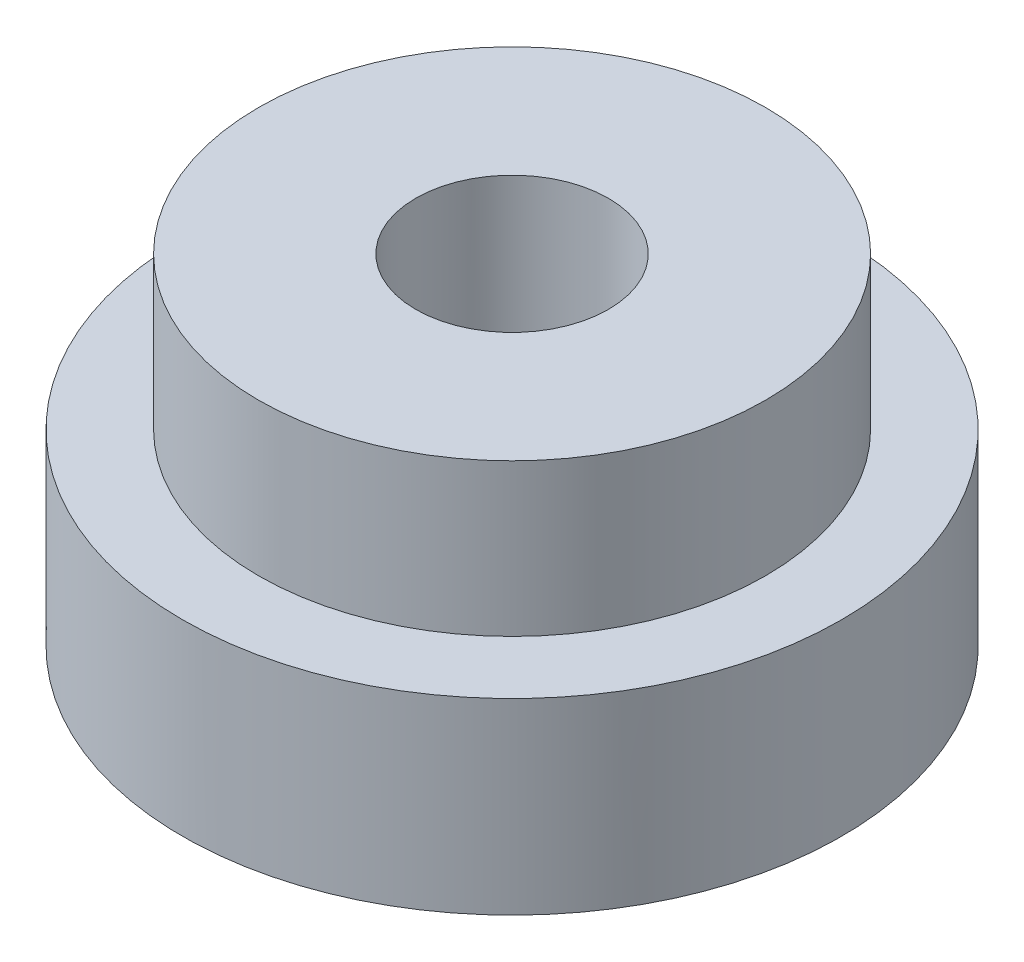
ISO-10303-21;
HEADER;
FILE_DESCRIPTION(('STEP AP214'),'2;1');
FILE_NAME('part.step','',(''),(''),'','','');
FILE_SCHEMA(('AUTOMOTIVE_DESIGN { 1 0 10303 214 1 1 1 1 }'));
ENDSEC;
DATA;
#1=APPLICATION_CONTEXT('core data for automotive mechanical design processes');
#2=APPLICATION_PROTOCOL_DEFINITION('international standard','automotive_design',2000,#1);
#3=PRODUCT_CONTEXT('',#1,'mechanical');
#4=PRODUCT('Part','Part','',(#3));
#5=PRODUCT_RELATED_PRODUCT_CATEGORY('part','',(#4));
#6=PRODUCT_DEFINITION_FORMATION('','',#4);
#7=PRODUCT_DEFINITION_CONTEXT('part definition',#1,'design');
#8=PRODUCT_DEFINITION('design','',#6,#7);
#9=PRODUCT_DEFINITION_SHAPE('','',#8);
#10=(LENGTH_UNIT() NAMED_UNIT(*) SI_UNIT(.MILLI.,.METRE.));
#11=(NAMED_UNIT(*) PLANE_ANGLE_UNIT() SI_UNIT($,.RADIAN.));
#12=(NAMED_UNIT(*) SI_UNIT($,.STERADIAN.) SOLID_ANGLE_UNIT());
#13=UNCERTAINTY_MEASURE_WITH_UNIT(LENGTH_MEASURE(1.E-05),#10,'distance_accuracy_value','');
#14=(GEOMETRIC_REPRESENTATION_CONTEXT(3) GLOBAL_UNCERTAINTY_ASSIGNED_CONTEXT((#13)) GLOBAL_UNIT_ASSIGNED_CONTEXT((#10,
#11,#12)) REPRESENTATION_CONTEXT('',''));
#15=CARTESIAN_POINT('',(0.,0.,0.));
#16=DIRECTION('',(0.,0.,1.));
#17=DIRECTION('',(1.,0.,0.));
#18=AXIS2_PLACEMENT_3D('',#15,#16,#17);
#19=CARTESIAN_POINT('',(0.,1.2,0.));
#20=DIRECTION('',(0.,1.,0.));
#21=DIRECTION('',(0.,0.,1.));
#22=AXIS2_PLACEMENT_3D('',#19,#20,#21);
#23=PLANE('',#22);
#24=CARTESIAN_POINT('',(0.,1.2,0.));
#25=DIRECTION('',(0.,1.,0.));
#26=DIRECTION('',(0.,0.,1.));
#27=AXIS2_PLACEMENT_3D('',#24,#25,#26);
#28=CIRCLE('',#27,6.5);
#29=CARTESIAN_POINT('',(0.,1.2,6.5));
#30=VERTEX_POINT('',#29);
#31=EDGE_CURVE('E11',#30,#30,#28,.T.);
#32=ORIENTED_EDGE('',*,*,#31,.T.);
#33=EDGE_LOOP('',(#32));
#34=FACE_BOUND('',#33,.T.);
#35=CARTESIAN_POINT('',(0.,1.2,0.));
#36=DIRECTION('',(0.,1.,0.));
#37=DIRECTION('',(0.,0.,1.));
#38=AXIS2_PLACEMENT_3D('',#35,#36,#37);
#39=CIRCLE('',#38,5.);
#40=CARTESIAN_POINT('',(0.,1.2,5.));
#41=VERTEX_POINT('',#40);
#42=EDGE_CURVE('E150',#41,#41,#39,.T.);
#43=ORIENTED_EDGE('',*,*,#42,.F.);
#44=EDGE_LOOP('',(#43));
#45=FACE_BOUND('',#44,.T.);
#46=ADVANCED_FACE('F33',(#34,#45),#23,.T.);
#47=CARTESIAN_POINT('',(0.,1.2,0.));
#48=DIRECTION('',(0.,-1.,0.));
#49=DIRECTION('',(0.,0.,-1.));
#50=AXIS2_PLACEMENT_3D('',#47,#48,#49);
#51=CYLINDRICAL_SURFACE('',#50,6.5);
#52=ORIENTED_EDGE('',*,*,#31,.F.);
#53=EDGE_LOOP('',(#52));
#54=FACE_BOUND('',#53,.T.);
#55=CARTESIAN_POINT('',(0.,-2.5,0.));
#56=DIRECTION('',(0.,-1.,0.));
#57=DIRECTION('',(0.,0.,-1.));
#58=AXIS2_PLACEMENT_3D('',#55,#56,#57);
#59=CIRCLE('',#58,6.5);
#60=CARTESIAN_POINT('',(0.,-2.5,-6.5));
#61=VERTEX_POINT('',#60);
#62=EDGE_CURVE('E144',#61,#61,#59,.T.);
#63=ORIENTED_EDGE('',*,*,#62,.F.);
#64=EDGE_LOOP('',(#63));
#65=FACE_BOUND('',#64,.T.);
#66=ADVANCED_FACE('F35',(#54,#65),#51,.T.);
#67=CARTESIAN_POINT('',(0.,4.2,0.));
#68=DIRECTION('',(0.,-1.,0.));
#69=DIRECTION('',(0.,0.,-1.));
#70=AXIS2_PLACEMENT_3D('',#67,#68,#69);
#71=CYLINDRICAL_SURFACE('',#70,5.);
#72=CARTESIAN_POINT('',(0.,4.2,0.));
#73=DIRECTION('',(0.,1.,0.));
#74=DIRECTION('',(0.,0.,1.));
#75=AXIS2_PLACEMENT_3D('',#72,#73,#74);
#76=CIRCLE('',#75,5.);
#77=CARTESIAN_POINT('',(0.,4.2,5.));
#78=VERTEX_POINT('',#77);
#79=EDGE_CURVE('E41',#78,#78,#76,.T.);
#80=ORIENTED_EDGE('',*,*,#79,.F.);
#81=EDGE_LOOP('',(#80));
#82=FACE_BOUND('',#81,.T.);
#83=ORIENTED_EDGE('',*,*,#42,.T.);
#84=EDGE_LOOP('',(#83));
#85=FACE_BOUND('',#84,.T.);
#86=ADVANCED_FACE('F155',(#82,#85),#71,.T.);
#87=CARTESIAN_POINT('',(0.,4.2,0.));
#88=DIRECTION('',(0.,1.,0.));
#89=DIRECTION('',(0.,0.,1.));
#90=AXIS2_PLACEMENT_3D('',#87,#88,#89);
#91=PLANE('',#90);
#92=CARTESIAN_POINT('',(0.,4.2,0.));
#93=DIRECTION('',(0.,1.,0.));
#94=DIRECTION('',(0.,0.,1.));
#95=AXIS2_PLACEMENT_3D('',#92,#93,#94);
#96=CIRCLE('',#95,1.9);
#97=CARTESIAN_POINT('',(0.,4.2,1.9));
#98=VERTEX_POINT('',#97);
#99=EDGE_CURVE('E147',#98,#98,#96,.F.);
#100=ORIENTED_EDGE('',*,*,#99,.T.);
#101=EDGE_LOOP('',(#100));
#102=FACE_BOUND('',#101,.T.);
#103=ORIENTED_EDGE('',*,*,#79,.T.);
#104=EDGE_LOOP('',(#103));
#105=FACE_BOUND('',#104,.T.);
#106=ADVANCED_FACE('F166',(#102,#105),#91,.T.);
#107=CARTESIAN_POINT('',(0.,4.201,0.));
#108=DIRECTION('',(0.,-1.,0.));
#109=DIRECTION('',(0.,0.,-1.));
#110=AXIS2_PLACEMENT_3D('',#107,#108,#109);
#111=CYLINDRICAL_SURFACE('',#110,1.9);
#112=ORIENTED_EDGE('',*,*,#99,.F.);
#113=EDGE_LOOP('',(#112));
#114=FACE_BOUND('',#113,.T.);
#115=CARTESIAN_POINT('',(0.,0.,0.));
#116=DIRECTION('',(0.,-1.,0.));
#117=DIRECTION('',(0.,0.,-1.));
#118=AXIS2_PLACEMENT_3D('',#115,#116,#117);
#119=CIRCLE('',#118,1.9);
#120=CARTESIAN_POINT('',(0.,0.,-1.9));
#121=VERTEX_POINT('',#120);
#122=EDGE_CURVE('E136',#121,#121,#119,.F.);
#123=ORIENTED_EDGE('',*,*,#122,.F.);
#124=EDGE_LOOP('',(#123));
#125=FACE_BOUND('',#124,.T.);
#126=ADVANCED_FACE('F170',(#114,#125),#111,.F.);
#127=CARTESIAN_POINT('',(0.,-2.5,0.));
#128=DIRECTION('',(0.,-1.,0.));
#129=DIRECTION('',(0.,0.,-1.));
#130=AXIS2_PLACEMENT_3D('',#127,#128,#129);
#131=PLANE('',#130);
#132=DIRECTION('',(-0.770627913577785,0.,-0.63728535116912));
#133=VECTOR('',#132,1.);
#134=CARTESIAN_POINT('',(-0.586707509350836,-2.5,3.47262258700894));
#135=LINE('',#134,#133);
#136=CARTESIAN_POINT('',(-0.586707509350836,-2.5,3.47262258700894));
#137=VERTEX_POINT('',#136);
#138=CARTESIAN_POINT('',(-3.3007331327808,-2.5,1.22820768581555));
#139=VERTEX_POINT('',#138);
#140=EDGE_CURVE('E48',#137,#139,#135,.T.);
#141=ORIENTED_EDGE('',*,*,#140,.F.);
#142=DIRECTION('',(-0.937219260361038,0.,0.348740674439201));
#143=VECTOR('',#142,1.);
#144=CARTESIAN_POINT('',(2.71402562342996,-2.5,2.24441490119339));
#145=LINE('',#144,#143);
#146=CARTESIAN_POINT('',(2.71402562342996,-2.5,2.24441490119339));
#147=VERTEX_POINT('',#146);
#148=EDGE_CURVE('E132',#147,#137,#145,.T.);
#149=ORIENTED_EDGE('',*,*,#148,.F.);
#150=DIRECTION('',(-0.166591346783252,0.,0.986026025608321));
#151=VECTOR('',#150,1.);
#152=CARTESIAN_POINT('',(3.3007331327808,-2.5,-1.22820768581555));
#153=LINE('',#152,#151);
#154=CARTESIAN_POINT('',(3.3007331327808,-2.5,-1.22820768581555));
#155=VERTEX_POINT('',#154);
#156=EDGE_CURVE('E130',#155,#147,#153,.T.);
#157=ORIENTED_EDGE('',*,*,#156,.F.);
#158=DIRECTION('',(0.770627913577785,0.,0.637285351169121));
#159=VECTOR('',#158,1.);
#160=CARTESIAN_POINT('',(0.586707509350836,-2.5,-3.47262258700894));
#161=LINE('',#160,#159);
#162=CARTESIAN_POINT('',(0.586707509350836,-2.5,-3.47262258700894));
#163=VERTEX_POINT('',#162);
#164=EDGE_CURVE('E96',#163,#155,#161,.T.);
#165=ORIENTED_EDGE('',*,*,#164,.F.);
#166=DIRECTION('',(0.937219260361038,0.,-0.348740674439201));
#167=VECTOR('',#166,1.);
#168=CARTESIAN_POINT('',(-2.71402562342996,-2.5,-2.24441490119339));
#169=LINE('',#168,#167);
#170=CARTESIAN_POINT('',(-2.71402562342996,-2.5,-2.24441490119339));
#171=VERTEX_POINT('',#170);
#172=EDGE_CURVE('E126',#171,#163,#169,.T.);
#173=ORIENTED_EDGE('',*,*,#172,.F.);
#174=DIRECTION('',(0.166591346783253,0.,-0.986026025608321));
#175=VECTOR('',#174,1.);
#176=CARTESIAN_POINT('',(-3.3007331327808,-2.5,1.22820768581555));
#177=LINE('',#176,#175);
#178=EDGE_CURVE('E123',#139,#171,#177,.T.);
#179=ORIENTED_EDGE('',*,*,#178,.F.);
#180=EDGE_LOOP('',(#141,#149,#157,#165,#173,#179));
#181=FACE_BOUND('',#180,.T.);
#182=ORIENTED_EDGE('',*,*,#62,.T.);
#183=EDGE_LOOP('',(#182));
#184=FACE_BOUND('',#183,.T.);
#185=ADVANCED_FACE('F174',(#181,#184),#131,.T.);
#186=CARTESIAN_POINT('',(0.,0.,0.));
#187=DIRECTION('',(0.,-1.,0.));
#188=DIRECTION('',(0.,0.,-1.));
#189=AXIS2_PLACEMENT_3D('',#186,#187,#188);
#190=PLANE('',#189);
#191=DIRECTION('',(-0.770627913577785,0.,-0.63728535116912));
#192=VECTOR('',#191,1.);
#193=CARTESIAN_POINT('',(-0.586707509350836,0.,3.47262258700894));
#194=LINE('',#193,#192);
#195=CARTESIAN_POINT('',(-0.586707509350836,0.,3.47262258700894));
#196=VERTEX_POINT('',#195);
#197=CARTESIAN_POINT('',(-3.3007331327808,0.,1.22820768581555));
#198=VERTEX_POINT('',#197);
#199=EDGE_CURVE('E134',#196,#198,#194,.T.);
#200=ORIENTED_EDGE('',*,*,#199,.T.);
#201=DIRECTION('',(0.166591346783253,0.,-0.986026025608321));
#202=VECTOR('',#201,1.);
#203=CARTESIAN_POINT('',(-3.3007331327808,0.,1.22820768581555));
#204=LINE('',#203,#202);
#205=CARTESIAN_POINT('',(-2.71402562342996,0.,-2.24441490119339));
#206=VERTEX_POINT('',#205);
#207=EDGE_CURVE('E117',#198,#206,#204,.T.);
#208=ORIENTED_EDGE('',*,*,#207,.T.);
#209=DIRECTION('',(0.937219260361038,0.,-0.348740674439201));
#210=VECTOR('',#209,1.);
#211=CARTESIAN_POINT('',(-2.71402562342996,0.,-2.24441490119339));
#212=LINE('',#211,#210);
#213=CARTESIAN_POINT('',(0.586707509350836,0.,-3.47262258700894));
#214=VERTEX_POINT('',#213);
#215=EDGE_CURVE('E115',#206,#214,#212,.T.);
#216=ORIENTED_EDGE('',*,*,#215,.T.);
#217=DIRECTION('',(0.770627913577785,0.,0.637285351169121));
#218=VECTOR('',#217,1.);
#219=CARTESIAN_POINT('',(0.586707509350836,0.,-3.47262258700894));
#220=LINE('',#219,#218);
#221=CARTESIAN_POINT('',(3.3007331327808,0.,-1.22820768581555));
#222=VERTEX_POINT('',#221);
#223=EDGE_CURVE('E93',#214,#222,#220,.T.);
#224=ORIENTED_EDGE('',*,*,#223,.T.);
#225=DIRECTION('',(-0.166591346783252,0.,0.986026025608321));
#226=VECTOR('',#225,1.);
#227=CARTESIAN_POINT('',(3.3007331327808,0.,-1.22820768581555));
#228=LINE('',#227,#226);
#229=CARTESIAN_POINT('',(2.71402562342996,0.,2.24441490119339));
#230=VERTEX_POINT('',#229);
#231=EDGE_CURVE('E104',#222,#230,#228,.T.);
#232=ORIENTED_EDGE('',*,*,#231,.T.);
#233=DIRECTION('',(-0.937219260361038,0.,0.348740674439201));
#234=VECTOR('',#233,1.);
#235=CARTESIAN_POINT('',(2.71402562342996,0.,2.24441490119339));
#236=LINE('',#235,#234);
#237=EDGE_CURVE('E108',#230,#196,#236,.T.);
#238=ORIENTED_EDGE('',*,*,#237,.T.);
#239=EDGE_LOOP('',(#200,#208,#216,#224,#232,#238));
#240=FACE_BOUND('',#239,.T.);
#241=ORIENTED_EDGE('',*,*,#122,.T.);
#242=EDGE_LOOP('',(#241));
#243=FACE_BOUND('',#242,.T.);
#244=ADVANCED_FACE('F111',(#240,#243),#190,.T.);
#245=CARTESIAN_POINT('',(-0.586707509350836,0.,3.47262258700894));
#246=DIRECTION('',(-0.637285351169121,0.,0.770627913577785));
#247=DIRECTION('',(0.770627913577785,0.,0.637285351169121));
#248=AXIS2_PLACEMENT_3D('',#245,#246,#247);
#249=PLANE('',#248);
#250=ORIENTED_EDGE('',*,*,#140,.T.);
#251=DIRECTION('',(0.,-1.,0.));
#252=VECTOR('',#251,1.);
#253=CARTESIAN_POINT('',(-3.3007331327808,0.,1.22820768581555));
#254=LINE('',#253,#252);
#255=EDGE_CURVE('E78',#198,#139,#254,.T.);
#256=ORIENTED_EDGE('',*,*,#255,.F.);
#257=ORIENTED_EDGE('',*,*,#199,.F.);
#258=DIRECTION('',(0.,-1.,0.));
#259=VECTOR('',#258,1.);
#260=CARTESIAN_POINT('',(-0.586707509350836,0.,3.47262258700894));
#261=LINE('',#260,#259);
#262=EDGE_CURVE('E56',#196,#137,#261,.T.);
#263=ORIENTED_EDGE('',*,*,#262,.T.);
#264=EDGE_LOOP('',(#250,#256,#257,#263));
#265=FACE_BOUND('',#264,.T.);
#266=ADVANCED_FACE('F179',(#265),#249,.F.);
#267=CARTESIAN_POINT('',(2.71402562342996,0.,2.24441490119339));
#268=DIRECTION('',(0.348740674439201,0.,0.937219260361038));
#269=DIRECTION('',(0.937219260361038,0.,-0.348740674439201));
#270=AXIS2_PLACEMENT_3D('',#267,#268,#269);
#271=PLANE('',#270);
#272=ORIENTED_EDGE('',*,*,#148,.T.);
#273=ORIENTED_EDGE('',*,*,#262,.F.);
#274=ORIENTED_EDGE('',*,*,#237,.F.);
#275=DIRECTION('',(0.,-1.,0.));
#276=VECTOR('',#275,1.);
#277=CARTESIAN_POINT('',(2.71402562342996,0.,2.24441490119339));
#278=LINE('',#277,#276);
#279=EDGE_CURVE('E100',#230,#147,#278,.T.);
#280=ORIENTED_EDGE('',*,*,#279,.T.);
#281=EDGE_LOOP('',(#272,#273,#274,#280));
#282=FACE_BOUND('',#281,.T.);
#283=ADVANCED_FACE('F182',(#282),#271,.F.);
#284=CARTESIAN_POINT('',(3.3007331327808,0.,-1.22820768581555));
#285=DIRECTION('',(0.986026025608321,0.,0.166591346783252));
#286=DIRECTION('',(0.166591346783252,0.,-0.986026025608321));
#287=AXIS2_PLACEMENT_3D('',#284,#285,#286);
#288=PLANE('',#287);
#289=ORIENTED_EDGE('',*,*,#156,.T.);
#290=ORIENTED_EDGE('',*,*,#279,.F.);
#291=ORIENTED_EDGE('',*,*,#231,.F.);
#292=DIRECTION('',(0.,-1.,0.));
#293=VECTOR('',#292,1.);
#294=CARTESIAN_POINT('',(3.3007331327808,0.,-1.22820768581555));
#295=LINE('',#294,#293);
#296=EDGE_CURVE('E89',#222,#155,#295,.T.);
#297=ORIENTED_EDGE('',*,*,#296,.T.);
#298=EDGE_LOOP('',(#289,#290,#291,#297));
#299=FACE_BOUND('',#298,.T.);
#300=ADVANCED_FACE('F105',(#299),#288,.F.);
#301=CARTESIAN_POINT('',(0.586707509350836,0.,-3.47262258700894));
#302=DIRECTION('',(0.637285351169121,0.,-0.770627913577785));
#303=DIRECTION('',(-0.770627913577785,0.,-0.637285351169121));
#304=AXIS2_PLACEMENT_3D('',#301,#302,#303);
#305=PLANE('',#304);
#306=ORIENTED_EDGE('',*,*,#164,.T.);
#307=ORIENTED_EDGE('',*,*,#296,.F.);
#308=ORIENTED_EDGE('',*,*,#223,.F.);
#309=DIRECTION('',(0.,-1.,0.));
#310=VECTOR('',#309,1.);
#311=CARTESIAN_POINT('',(0.586707509350836,0.,-3.47262258700894));
#312=LINE('',#311,#310);
#313=EDGE_CURVE('E101',#214,#163,#312,.T.);
#314=ORIENTED_EDGE('',*,*,#313,.T.);
#315=EDGE_LOOP('',(#306,#307,#308,#314));
#316=FACE_BOUND('',#315,.T.);
#317=ADVANCED_FACE('F91',(#316),#305,.F.);
#318=CARTESIAN_POINT('',(-2.71402562342996,0.,-2.24441490119339));
#319=DIRECTION('',(-0.348740674439201,0.,-0.937219260361038));
#320=DIRECTION('',(-0.937219260361038,0.,0.348740674439201));
#321=AXIS2_PLACEMENT_3D('',#318,#319,#320);
#322=PLANE('',#321);
#323=ORIENTED_EDGE('',*,*,#172,.T.);
#324=ORIENTED_EDGE('',*,*,#313,.F.);
#325=ORIENTED_EDGE('',*,*,#215,.F.);
#326=DIRECTION('',(0.,-1.,0.));
#327=VECTOR('',#326,1.);
#328=CARTESIAN_POINT('',(-2.71402562342996,0.,-2.24441490119339));
#329=LINE('',#328,#327);
#330=EDGE_CURVE('E139',#206,#171,#329,.T.);
#331=ORIENTED_EDGE('',*,*,#330,.T.);
#332=EDGE_LOOP('',(#323,#324,#325,#331));
#333=FACE_BOUND('',#332,.T.);
#334=ADVANCED_FACE('F186',(#333),#322,.F.);
#335=CARTESIAN_POINT('',(-3.3007331327808,0.,1.22820768581555));
#336=DIRECTION('',(-0.986026025608321,0.,-0.166591346783253));
#337=DIRECTION('',(-0.166591346783253,0.,0.986026025608321));
#338=AXIS2_PLACEMENT_3D('',#335,#336,#337);
#339=PLANE('',#338);
#340=ORIENTED_EDGE('',*,*,#178,.T.);
#341=ORIENTED_EDGE('',*,*,#330,.F.);
#342=ORIENTED_EDGE('',*,*,#207,.F.);
#343=ORIENTED_EDGE('',*,*,#255,.T.);
#344=EDGE_LOOP('',(#340,#341,#342,#343));
#345=FACE_BOUND('',#344,.T.);
#346=ADVANCED_FACE('F183',(#345),#339,.F.);
#347=CLOSED_SHELL('',(#46,#66,#86,#106,#126,#185,#244,#266,#283,#300,#317,#334,#346));
#348=MANIFOLD_SOLID_BREP('B2',#347);
#349=ADVANCED_BREP_SHAPE_REPRESENTATION('',(#18,#348),#14);
#350=SHAPE_DEFINITION_REPRESENTATION(#9,#349);
ENDSEC;
END-ISO-10303-21;
